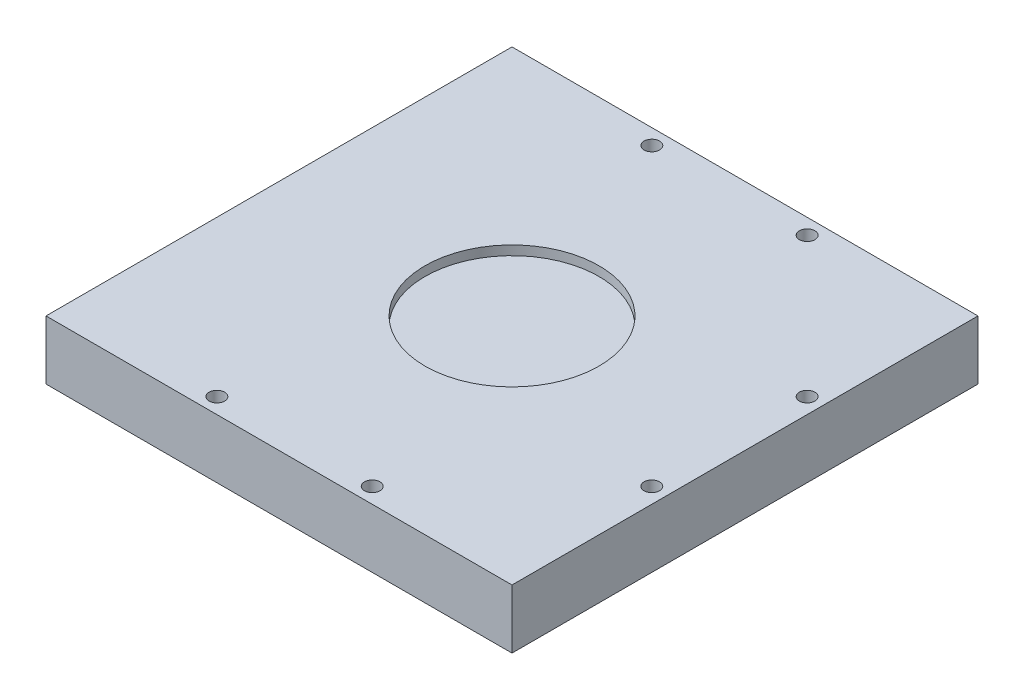
ISO-10303-21;
HEADER;
FILE_DESCRIPTION(('STEP AP214'),'2;1');
FILE_NAME('part.step','',(''),(''),'','','');
FILE_SCHEMA(('AUTOMOTIVE_DESIGN { 1 0 10303 214 1 1 1 1 }'));
ENDSEC;
DATA;
#1=APPLICATION_CONTEXT('core data for automotive mechanical design processes');
#2=APPLICATION_PROTOCOL_DEFINITION('international standard','automotive_design',2000,#1);
#3=PRODUCT_CONTEXT('',#1,'mechanical');
#4=PRODUCT('Part','Part','',(#3));
#5=PRODUCT_RELATED_PRODUCT_CATEGORY('part','',(#4));
#6=PRODUCT_DEFINITION_FORMATION('','',#4);
#7=PRODUCT_DEFINITION_CONTEXT('part definition',#1,'design');
#8=PRODUCT_DEFINITION('design','',#6,#7);
#9=PRODUCT_DEFINITION_SHAPE('','',#8);
#10=(LENGTH_UNIT() NAMED_UNIT(*) SI_UNIT(.MILLI.,.METRE.));
#11=(NAMED_UNIT(*) PLANE_ANGLE_UNIT() SI_UNIT($,.RADIAN.));
#12=(NAMED_UNIT(*) SI_UNIT($,.STERADIAN.) SOLID_ANGLE_UNIT());
#13=UNCERTAINTY_MEASURE_WITH_UNIT(LENGTH_MEASURE(1.E-05),#10,'distance_accuracy_value','');
#14=(GEOMETRIC_REPRESENTATION_CONTEXT(3) GLOBAL_UNCERTAINTY_ASSIGNED_CONTEXT((#13)) GLOBAL_UNIT_ASSIGNED_CONTEXT((#10,
#11,#12)) REPRESENTATION_CONTEXT('',''));
#15=CARTESIAN_POINT('',(0.,0.,0.));
#16=DIRECTION('',(0.,0.,1.));
#17=DIRECTION('',(1.,0.,0.));
#18=AXIS2_PLACEMENT_3D('',#15,#16,#17);
#19=CARTESIAN_POINT('',(0.,19.,0.));
#20=DIRECTION('',(1.,0.,0.));
#21=DIRECTION('',(0.,0.,-1.));
#22=AXIS2_PLACEMENT_3D('',#19,#20,#21);
#23=PLANE('',#22);
#24=DIRECTION('',(0.,0.,1.));
#25=VECTOR('',#24,1.);
#26=CARTESIAN_POINT('',(0.,0.,0.));
#27=LINE('',#26,#25);
#28=CARTESIAN_POINT('',(0.,0.,-150.));
#29=VERTEX_POINT('',#28);
#30=CARTESIAN_POINT('',(0.,0.,0.));
#31=VERTEX_POINT('',#30);
#32=EDGE_CURVE('E106',#29,#31,#27,.T.);
#33=ORIENTED_EDGE('',*,*,#32,.T.);
#34=DIRECTION('',(0.,-1.,0.));
#35=VECTOR('',#34,1.);
#36=CARTESIAN_POINT('',(0.,19.,0.));
#37=LINE('',#36,#35);
#38=CARTESIAN_POINT('',(0.,19.,0.));
#39=VERTEX_POINT('',#38);
#40=EDGE_CURVE('E11',#39,#31,#37,.T.);
#41=ORIENTED_EDGE('',*,*,#40,.F.);
#42=DIRECTION('',(0.,0.,1.));
#43=VECTOR('',#42,1.);
#44=CARTESIAN_POINT('',(0.,19.,0.));
#45=LINE('',#44,#43);
#46=CARTESIAN_POINT('',(0.,19.,-150.));
#47=VERTEX_POINT('',#46);
#48=EDGE_CURVE('E90',#47,#39,#45,.T.);
#49=ORIENTED_EDGE('',*,*,#48,.F.);
#50=DIRECTION('',(0.,-1.,0.));
#51=VECTOR('',#50,1.);
#52=CARTESIAN_POINT('',(0.,19.,-150.));
#53=LINE('',#52,#51);
#54=EDGE_CURVE('E102',#47,#29,#53,.T.);
#55=ORIENTED_EDGE('',*,*,#54,.T.);
#56=EDGE_LOOP('',(#33,#41,#49,#55));
#57=FACE_BOUND('',#56,.T.);
#58=ADVANCED_FACE('F38',(#57),#23,.F.);
#59=CARTESIAN_POINT('',(0.,19.,0.));
#60=DIRECTION('',(0.,0.,-1.));
#61=DIRECTION('',(-1.,0.,0.));
#62=AXIS2_PLACEMENT_3D('',#59,#60,#61);
#63=PLANE('',#62);
#64=DIRECTION('',(1.,0.,0.));
#65=VECTOR('',#64,1.);
#66=CARTESIAN_POINT('',(0.,0.,0.));
#67=LINE('',#66,#65);
#68=CARTESIAN_POINT('',(150.,0.,0.));
#69=VERTEX_POINT('',#68);
#70=EDGE_CURVE('E95',#31,#69,#67,.T.);
#71=ORIENTED_EDGE('',*,*,#70,.T.);
#72=DIRECTION('',(0.,-1.,0.));
#73=VECTOR('',#72,1.);
#74=CARTESIAN_POINT('',(150.,19.,0.));
#75=LINE('',#74,#73);
#76=CARTESIAN_POINT('',(150.,19.,0.));
#77=VERTEX_POINT('',#76);
#78=EDGE_CURVE('E47',#77,#69,#75,.T.);
#79=ORIENTED_EDGE('',*,*,#78,.F.);
#80=DIRECTION('',(1.,0.,0.));
#81=VECTOR('',#80,1.);
#82=CARTESIAN_POINT('',(0.,19.,0.));
#83=LINE('',#82,#81);
#84=EDGE_CURVE('E85',#39,#77,#83,.T.);
#85=ORIENTED_EDGE('',*,*,#84,.F.);
#86=ORIENTED_EDGE('',*,*,#40,.T.);
#87=EDGE_LOOP('',(#71,#79,#85,#86));
#88=FACE_BOUND('',#87,.T.);
#89=ADVANCED_FACE('F94',(#88),#63,.F.);
#90=CARTESIAN_POINT('',(150.,19.,0.));
#91=DIRECTION('',(-1.,0.,0.));
#92=DIRECTION('',(0.,0.,1.));
#93=AXIS2_PLACEMENT_3D('',#90,#91,#92);
#94=PLANE('',#93);
#95=DIRECTION('',(0.,0.,-1.));
#96=VECTOR('',#95,1.);
#97=CARTESIAN_POINT('',(150.,0.,0.));
#98=LINE('',#97,#96);
#99=CARTESIAN_POINT('',(150.,0.,-150.));
#100=VERTEX_POINT('',#99);
#101=EDGE_CURVE('E72',#69,#100,#98,.T.);
#102=ORIENTED_EDGE('',*,*,#101,.T.);
#103=DIRECTION('',(0.,-1.,0.));
#104=VECTOR('',#103,1.);
#105=CARTESIAN_POINT('',(150.,19.,-150.));
#106=LINE('',#105,#104);
#107=CARTESIAN_POINT('',(150.,19.,-150.));
#108=VERTEX_POINT('',#107);
#109=EDGE_CURVE('E97',#108,#100,#106,.T.);
#110=ORIENTED_EDGE('',*,*,#109,.F.);
#111=DIRECTION('',(0.,0.,-1.));
#112=VECTOR('',#111,1.);
#113=CARTESIAN_POINT('',(150.,19.,0.));
#114=LINE('',#113,#112);
#115=EDGE_CURVE('E88',#77,#108,#114,.T.);
#116=ORIENTED_EDGE('',*,*,#115,.F.);
#117=ORIENTED_EDGE('',*,*,#78,.T.);
#118=EDGE_LOOP('',(#102,#110,#116,#117));
#119=FACE_BOUND('',#118,.T.);
#120=ADVANCED_FACE('F98',(#119),#94,.F.);
#121=CARTESIAN_POINT('',(0.,19.,-150.));
#122=DIRECTION('',(0.,0.,1.));
#123=DIRECTION('',(1.,0.,0.));
#124=AXIS2_PLACEMENT_3D('',#121,#122,#123);
#125=PLANE('',#124);
#126=DIRECTION('',(-1.,0.,0.));
#127=VECTOR('',#126,1.);
#128=CARTESIAN_POINT('',(0.,0.,-150.));
#129=LINE('',#128,#127);
#130=EDGE_CURVE('E78',#100,#29,#129,.T.);
#131=ORIENTED_EDGE('',*,*,#130,.T.);
#132=ORIENTED_EDGE('',*,*,#54,.F.);
#133=DIRECTION('',(-1.,0.,0.));
#134=VECTOR('',#133,1.);
#135=CARTESIAN_POINT('',(0.,19.,-150.));
#136=LINE('',#135,#134);
#137=EDGE_CURVE('E55',#108,#47,#136,.T.);
#138=ORIENTED_EDGE('',*,*,#137,.F.);
#139=ORIENTED_EDGE('',*,*,#109,.T.);
#140=EDGE_LOOP('',(#131,#132,#138,#139));
#141=FACE_BOUND('',#140,.T.);
#142=ADVANCED_FACE('F120',(#141),#125,.F.);
#143=CARTESIAN_POINT('',(0.,19.,0.));
#144=DIRECTION('',(0.,-1.,0.));
#145=DIRECTION('',(0.,0.,-1.));
#146=AXIS2_PLACEMENT_3D('',#143,#144,#145);
#147=PLANE('',#146);
#148=CARTESIAN_POINT('',(145.,19.,-50.0000000000003));
#149=DIRECTION('',(0.,1.,0.));
#150=DIRECTION('',(1.,0.,0.));
#151=AXIS2_PLACEMENT_3D('',#148,#149,#150);
#152=CIRCLE('',#151,2.5);
#153=CARTESIAN_POINT('',(147.5,19.,-50.0000000000003));
#154=VERTEX_POINT('',#153);
#155=EDGE_CURVE('E175',#154,#154,#152,.T.);
#156=ORIENTED_EDGE('',*,*,#155,.F.);
#157=EDGE_LOOP('',(#156));
#158=FACE_BOUND('',#157,.T.);
#159=CARTESIAN_POINT('',(145.,19.,-100.));
#160=DIRECTION('',(0.,1.,0.));
#161=DIRECTION('',(1.,0.,0.));
#162=AXIS2_PLACEMENT_3D('',#159,#160,#161);
#163=CIRCLE('',#162,2.49999999999999);
#164=CARTESIAN_POINT('',(147.5,19.,-100.));
#165=VERTEX_POINT('',#164);
#166=EDGE_CURVE('E167',#165,#165,#163,.T.);
#167=ORIENTED_EDGE('',*,*,#166,.F.);
#168=EDGE_LOOP('',(#167));
#169=FACE_BOUND('',#168,.T.);
#170=CARTESIAN_POINT('',(100.,19.,-145.));
#171=DIRECTION('',(0.,1.,0.));
#172=DIRECTION('',(0.,0.,-1.));
#173=AXIS2_PLACEMENT_3D('',#170,#171,#172);
#174=CIRCLE('',#173,2.5);
#175=CARTESIAN_POINT('',(100.,19.,-147.5));
#176=VERTEX_POINT('',#175);
#177=EDGE_CURVE('E159',#176,#176,#174,.T.);
#178=ORIENTED_EDGE('',*,*,#177,.F.);
#179=EDGE_LOOP('',(#178));
#180=FACE_BOUND('',#179,.T.);
#181=CARTESIAN_POINT('',(50.,19.,-145.));
#182=DIRECTION('',(0.,1.,0.));
#183=DIRECTION('',(0.,0.,-1.));
#184=AXIS2_PLACEMENT_3D('',#181,#182,#183);
#185=CIRCLE('',#184,2.49999999999999);
#186=CARTESIAN_POINT('',(50.,19.,-147.5));
#187=VERTEX_POINT('',#186);
#188=EDGE_CURVE('E151',#187,#187,#185,.T.);
#189=ORIENTED_EDGE('',*,*,#188,.F.);
#190=EDGE_LOOP('',(#189));
#191=FACE_BOUND('',#190,.T.);
#192=CARTESIAN_POINT('',(50.,19.,-5.));
#193=DIRECTION('',(0.,1.,0.));
#194=DIRECTION('',(0.,0.,1.));
#195=AXIS2_PLACEMENT_3D('',#192,#193,#194);
#196=CIRCLE('',#195,2.5);
#197=CARTESIAN_POINT('',(50.,19.,-2.5));
#198=VERTEX_POINT('',#197);
#199=EDGE_CURVE('E144',#198,#198,#196,.T.);
#200=ORIENTED_EDGE('',*,*,#199,.F.);
#201=EDGE_LOOP('',(#200));
#202=FACE_BOUND('',#201,.T.);
#203=CARTESIAN_POINT('',(100.,19.,-5.));
#204=DIRECTION('',(0.,1.,0.));
#205=DIRECTION('',(0.,0.,1.));
#206=AXIS2_PLACEMENT_3D('',#203,#204,#205);
#207=CIRCLE('',#206,2.49999999999999);
#208=CARTESIAN_POINT('',(100.,19.,-2.50000000000001));
#209=VERTEX_POINT('',#208);
#210=EDGE_CURVE('E135',#209,#209,#207,.T.);
#211=ORIENTED_EDGE('',*,*,#210,.F.);
#212=EDGE_LOOP('',(#211));
#213=FACE_BOUND('',#212,.T.);
#214=CARTESIAN_POINT('',(75.,19.,-75.));
#215=DIRECTION('',(0.,1.,0.));
#216=DIRECTION('',(0.,0.,1.));
#217=AXIS2_PLACEMENT_3D('',#214,#215,#216);
#218=CIRCLE('',#217,28.);
#219=CARTESIAN_POINT('',(75.,19.,-47.));
#220=VERTEX_POINT('',#219);
#221=EDGE_CURVE('E127',#220,#220,#218,.T.);
#222=ORIENTED_EDGE('',*,*,#221,.F.);
#223=EDGE_LOOP('',(#222));
#224=FACE_BOUND('',#223,.T.);
#225=ORIENTED_EDGE('',*,*,#48,.T.);
#226=ORIENTED_EDGE('',*,*,#84,.T.);
#227=ORIENTED_EDGE('',*,*,#115,.T.);
#228=ORIENTED_EDGE('',*,*,#137,.T.);
#229=EDGE_LOOP('',(#225,#226,#227,#228));
#230=FACE_BOUND('',#229,.T.);
#231=ADVANCED_FACE('F86',(#158,#169,#180,#191,#202,#213,#224,#230),#147,.F.);
#232=CARTESIAN_POINT('',(0.,0.,0.));
#233=DIRECTION('',(0.,-1.,0.));
#234=DIRECTION('',(0.,0.,-1.));
#235=AXIS2_PLACEMENT_3D('',#232,#233,#234);
#236=PLANE('',#235);
#237=ORIENTED_EDGE('',*,*,#32,.F.);
#238=ORIENTED_EDGE('',*,*,#130,.F.);
#239=ORIENTED_EDGE('',*,*,#101,.F.);
#240=ORIENTED_EDGE('',*,*,#70,.F.);
#241=EDGE_LOOP('',(#237,#238,#239,#240));
#242=FACE_BOUND('',#241,.T.);
#243=ADVANCED_FACE('F123',(#242),#236,.T.);
#244=CARTESIAN_POINT('',(75.,16.,-75.));
#245=DIRECTION('',(0.,1.,0.));
#246=DIRECTION('',(0.,0.,1.));
#247=AXIS2_PLACEMENT_3D('',#244,#245,#246);
#248=CYLINDRICAL_SURFACE('',#247,28.);
#249=CARTESIAN_POINT('',(75.,16.,-75.));
#250=DIRECTION('',(0.,1.,0.));
#251=DIRECTION('',(0.,0.,1.));
#252=AXIS2_PLACEMENT_3D('',#249,#250,#251);
#253=CIRCLE('',#252,28.);
#254=CARTESIAN_POINT('',(75.,16.,-47.));
#255=VERTEX_POINT('',#254);
#256=EDGE_CURVE('E110',#255,#255,#253,.T.);
#257=ORIENTED_EDGE('',*,*,#256,.F.);
#258=EDGE_LOOP('',(#257));
#259=FACE_BOUND('',#258,.T.);
#260=ORIENTED_EDGE('',*,*,#221,.T.);
#261=EDGE_LOOP('',(#260));
#262=FACE_BOUND('',#261,.T.);
#263=ADVANCED_FACE('F207',(#259,#262),#248,.F.);
#264=CARTESIAN_POINT('',(75.,16.,-75.));
#265=DIRECTION('',(0.,1.,0.));
#266=DIRECTION('',(0.,0.,1.));
#267=AXIS2_PLACEMENT_3D('',#264,#265,#266);
#268=PLANE('',#267);
#269=ORIENTED_EDGE('',*,*,#256,.T.);
#270=EDGE_LOOP('',(#269));
#271=FACE_BOUND('',#270,.T.);
#272=ADVANCED_FACE('F209',(#271),#268,.T.);
#273=CARTESIAN_POINT('',(100.,14.,-5.));
#274=DIRECTION('',(0.,1.,0.));
#275=DIRECTION('',(0.,0.,1.));
#276=AXIS2_PLACEMENT_3D('',#273,#274,#275);
#277=CYLINDRICAL_SURFACE('',#276,2.49999999999999);
#278=CARTESIAN_POINT('',(100.,14.,-5.));
#279=DIRECTION('',(0.,1.,0.));
#280=DIRECTION('',(0.,0.,1.));
#281=AXIS2_PLACEMENT_3D('',#278,#279,#280);
#282=CIRCLE('',#281,2.49999999999999);
#283=CARTESIAN_POINT('',(100.,14.,-2.50000000000001));
#284=VERTEX_POINT('',#283);
#285=EDGE_CURVE('E139',#284,#284,#282,.T.);
#286=ORIENTED_EDGE('',*,*,#285,.F.);
#287=EDGE_LOOP('',(#286));
#288=FACE_BOUND('',#287,.T.);
#289=ORIENTED_EDGE('',*,*,#210,.T.);
#290=EDGE_LOOP('',(#289));
#291=FACE_BOUND('',#290,.T.);
#292=ADVANCED_FACE('F216',(#288,#291),#277,.F.);
#293=CARTESIAN_POINT('',(100.,14.,-5.));
#294=DIRECTION('',(0.,1.,0.));
#295=DIRECTION('',(0.,0.,1.));
#296=AXIS2_PLACEMENT_3D('',#293,#294,#295);
#297=PLANE('',#296);
#298=ORIENTED_EDGE('',*,*,#285,.T.);
#299=EDGE_LOOP('',(#298));
#300=FACE_BOUND('',#299,.T.);
#301=ADVANCED_FACE('F266',(#300),#297,.T.);
#302=CARTESIAN_POINT('',(50.,14.,-5.));
#303=DIRECTION('',(0.,1.,0.));
#304=DIRECTION('',(0.,0.,1.));
#305=AXIS2_PLACEMENT_3D('',#302,#303,#304);
#306=CYLINDRICAL_SURFACE('',#305,2.5);
#307=CARTESIAN_POINT('',(50.,14.,-5.));
#308=DIRECTION('',(0.,1.,0.));
#309=DIRECTION('',(0.,0.,1.));
#310=AXIS2_PLACEMENT_3D('',#307,#308,#309);
#311=CIRCLE('',#310,2.5);
#312=CARTESIAN_POINT('',(50.,14.,-2.5));
#313=VERTEX_POINT('',#312);
#314=EDGE_CURVE('E131',#313,#313,#311,.T.);
#315=ORIENTED_EDGE('',*,*,#314,.F.);
#316=EDGE_LOOP('',(#315));
#317=FACE_BOUND('',#316,.T.);
#318=ORIENTED_EDGE('',*,*,#199,.T.);
#319=EDGE_LOOP('',(#318));
#320=FACE_BOUND('',#319,.T.);
#321=ADVANCED_FACE('F276',(#317,#320),#306,.F.);
#322=CARTESIAN_POINT('',(50.,14.,-5.));
#323=DIRECTION('',(0.,1.,0.));
#324=DIRECTION('',(0.,0.,1.));
#325=AXIS2_PLACEMENT_3D('',#322,#323,#324);
#326=PLANE('',#325);
#327=ORIENTED_EDGE('',*,*,#314,.T.);
#328=EDGE_LOOP('',(#327));
#329=FACE_BOUND('',#328,.T.);
#330=ADVANCED_FACE('F285',(#329),#326,.T.);
#331=CARTESIAN_POINT('',(50.,14.,-145.));
#332=DIRECTION('',(0.,1.,0.));
#333=DIRECTION('',(0.,0.,1.));
#334=AXIS2_PLACEMENT_3D('',#331,#332,#333);
#335=CYLINDRICAL_SURFACE('',#334,2.49999999999999);
#336=CARTESIAN_POINT('',(50.,14.,-145.));
#337=DIRECTION('',(0.,1.,0.));
#338=DIRECTION('',(0.,0.,-1.));
#339=AXIS2_PLACEMENT_3D('',#336,#337,#338);
#340=CIRCLE('',#339,2.49999999999999);
#341=CARTESIAN_POINT('',(50.,14.,-147.5));
#342=VERTEX_POINT('',#341);
#343=EDGE_CURVE('E155',#342,#342,#340,.T.);
#344=ORIENTED_EDGE('',*,*,#343,.F.);
#345=EDGE_LOOP('',(#344));
#346=FACE_BOUND('',#345,.T.);
#347=ORIENTED_EDGE('',*,*,#188,.T.);
#348=EDGE_LOOP('',(#347));
#349=FACE_BOUND('',#348,.T.);
#350=ADVANCED_FACE('F294',(#346,#349),#335,.F.);
#351=CARTESIAN_POINT('',(50.,14.,-145.));
#352=DIRECTION('',(0.,1.,0.));
#353=DIRECTION('',(0.,0.,-1.));
#354=AXIS2_PLACEMENT_3D('',#351,#352,#353);
#355=PLANE('',#354);
#356=ORIENTED_EDGE('',*,*,#343,.T.);
#357=EDGE_LOOP('',(#356));
#358=FACE_BOUND('',#357,.T.);
#359=ADVANCED_FACE('F304',(#358),#355,.T.);
#360=CARTESIAN_POINT('',(100.,14.,-145.));
#361=DIRECTION('',(0.,1.,0.));
#362=DIRECTION('',(0.,0.,1.));
#363=AXIS2_PLACEMENT_3D('',#360,#361,#362);
#364=CYLINDRICAL_SURFACE('',#363,2.5);
#365=CARTESIAN_POINT('',(100.,14.,-145.));
#366=DIRECTION('',(0.,1.,0.));
#367=DIRECTION('',(0.,0.,-1.));
#368=AXIS2_PLACEMENT_3D('',#365,#366,#367);
#369=CIRCLE('',#368,2.5);
#370=CARTESIAN_POINT('',(100.,14.,-147.5));
#371=VERTEX_POINT('',#370);
#372=EDGE_CURVE('E163',#371,#371,#369,.T.);
#373=ORIENTED_EDGE('',*,*,#372,.F.);
#374=EDGE_LOOP('',(#373));
#375=FACE_BOUND('',#374,.T.);
#376=ORIENTED_EDGE('',*,*,#177,.T.);
#377=EDGE_LOOP('',(#376));
#378=FACE_BOUND('',#377,.T.);
#379=ADVANCED_FACE('F311',(#375,#378),#364,.F.);
#380=CARTESIAN_POINT('',(100.,14.,-145.));
#381=DIRECTION('',(0.,1.,0.));
#382=DIRECTION('',(0.,0.,-1.));
#383=AXIS2_PLACEMENT_3D('',#380,#381,#382);
#384=PLANE('',#383);
#385=ORIENTED_EDGE('',*,*,#372,.T.);
#386=EDGE_LOOP('',(#385));
#387=FACE_BOUND('',#386,.T.);
#388=ADVANCED_FACE('F319',(#387),#384,.T.);
#389=CARTESIAN_POINT('',(145.,14.,-100.));
#390=DIRECTION('',(0.,1.,0.));
#391=DIRECTION('',(0.,0.,1.));
#392=AXIS2_PLACEMENT_3D('',#389,#390,#391);
#393=CYLINDRICAL_SURFACE('',#392,2.49999999999999);
#394=CARTESIAN_POINT('',(145.,14.,-100.));
#395=DIRECTION('',(0.,1.,0.));
#396=DIRECTION('',(1.,0.,0.));
#397=AXIS2_PLACEMENT_3D('',#394,#395,#396);
#398=CIRCLE('',#397,2.49999999999999);
#399=CARTESIAN_POINT('',(147.5,14.,-100.));
#400=VERTEX_POINT('',#399);
#401=EDGE_CURVE('E171',#400,#400,#398,.T.);
#402=ORIENTED_EDGE('',*,*,#401,.F.);
#403=EDGE_LOOP('',(#402));
#404=FACE_BOUND('',#403,.T.);
#405=ORIENTED_EDGE('',*,*,#166,.T.);
#406=EDGE_LOOP('',(#405));
#407=FACE_BOUND('',#406,.T.);
#408=ADVANCED_FACE('F327',(#404,#407),#393,.F.);
#409=CARTESIAN_POINT('',(145.,14.,-100.));
#410=DIRECTION('',(0.,1.,0.));
#411=DIRECTION('',(1.,0.,0.));
#412=AXIS2_PLACEMENT_3D('',#409,#410,#411);
#413=PLANE('',#412);
#414=ORIENTED_EDGE('',*,*,#401,.T.);
#415=EDGE_LOOP('',(#414));
#416=FACE_BOUND('',#415,.T.);
#417=ADVANCED_FACE('F188',(#416),#413,.T.);
#418=CARTESIAN_POINT('',(145.,14.,-50.0000000000003));
#419=DIRECTION('',(0.,1.,0.));
#420=DIRECTION('',(0.,0.,1.));
#421=AXIS2_PLACEMENT_3D('',#418,#419,#420);
#422=CYLINDRICAL_SURFACE('',#421,2.5);
#423=CARTESIAN_POINT('',(145.,14.,-50.0000000000003));
#424=DIRECTION('',(0.,1.,0.));
#425=DIRECTION('',(1.,0.,0.));
#426=AXIS2_PLACEMENT_3D('',#423,#424,#425);
#427=CIRCLE('',#426,2.5);
#428=CARTESIAN_POINT('',(147.5,14.,-50.0000000000003));
#429=VERTEX_POINT('',#428);
#430=EDGE_CURVE('E140',#429,#429,#427,.T.);
#431=ORIENTED_EDGE('',*,*,#430,.F.);
#432=EDGE_LOOP('',(#431));
#433=FACE_BOUND('',#432,.T.);
#434=ORIENTED_EDGE('',*,*,#155,.T.);
#435=EDGE_LOOP('',(#434));
#436=FACE_BOUND('',#435,.T.);
#437=ADVANCED_FACE('F185',(#433,#436),#422,.F.);
#438=CARTESIAN_POINT('',(145.,14.,-50.0000000000003));
#439=DIRECTION('',(0.,1.,0.));
#440=DIRECTION('',(1.,0.,0.));
#441=AXIS2_PLACEMENT_3D('',#438,#439,#440);
#442=PLANE('',#441);
#443=ORIENTED_EDGE('',*,*,#430,.T.);
#444=EDGE_LOOP('',(#443));
#445=FACE_BOUND('',#444,.T.);
#446=ADVANCED_FACE('F183',(#445),#442,.T.);
#447=CLOSED_SHELL('',(#58,#89,#120,#142,#231,#243,#263,#272,#292,#301,#321,#330,#350,#359,#379,
#388,#408,#417,#437,#446));
#448=MANIFOLD_SOLID_BREP('B2',#447);
#449=ADVANCED_BREP_SHAPE_REPRESENTATION('',(#18,#448),#14);
#450=SHAPE_DEFINITION_REPRESENTATION(#9,#449);
ENDSEC;
END-ISO-10303-21;
